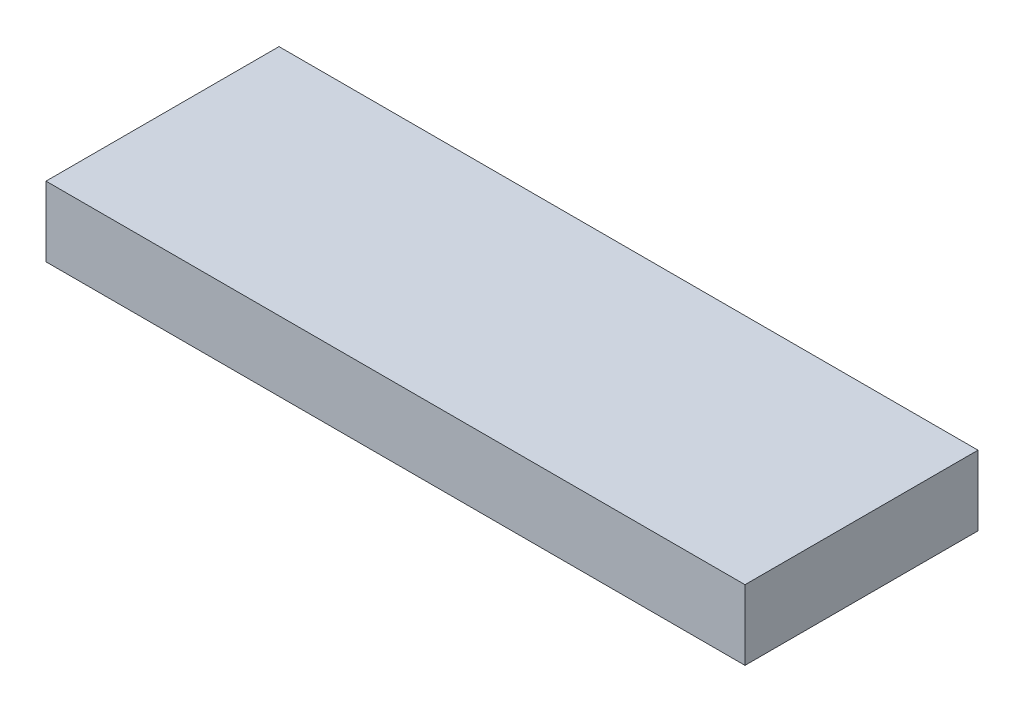
ISO-10303-21;
HEADER;
FILE_DESCRIPTION(('STEP AP214'),'2;1');
FILE_NAME('part.step','',(''),(''),'','','');
FILE_SCHEMA(('AUTOMOTIVE_DESIGN { 1 0 10303 214 1 1 1 1 }'));
ENDSEC;
DATA;
#1=APPLICATION_CONTEXT('core data for automotive mechanical design processes');
#2=APPLICATION_PROTOCOL_DEFINITION('international standard','automotive_design',2000,#1);
#3=PRODUCT_CONTEXT('',#1,'mechanical');
#4=PRODUCT('Part','Part','',(#3));
#5=PRODUCT_RELATED_PRODUCT_CATEGORY('part','',(#4));
#6=PRODUCT_DEFINITION_FORMATION('','',#4);
#7=PRODUCT_DEFINITION_CONTEXT('part definition',#1,'design');
#8=PRODUCT_DEFINITION('design','',#6,#7);
#9=PRODUCT_DEFINITION_SHAPE('','',#8);
#10=(LENGTH_UNIT() NAMED_UNIT(*) SI_UNIT(.MILLI.,.METRE.));
#11=(NAMED_UNIT(*) PLANE_ANGLE_UNIT() SI_UNIT($,.RADIAN.));
#12=(NAMED_UNIT(*) SI_UNIT($,.STERADIAN.) SOLID_ANGLE_UNIT());
#13=UNCERTAINTY_MEASURE_WITH_UNIT(LENGTH_MEASURE(1.E-05),#10,'distance_accuracy_value','');
#14=(GEOMETRIC_REPRESENTATION_CONTEXT(3) GLOBAL_UNCERTAINTY_ASSIGNED_CONTEXT((#13)) GLOBAL_UNIT_ASSIGNED_CONTEXT((#10,
#11,#12)) REPRESENTATION_CONTEXT('',''));
#15=CARTESIAN_POINT('',(0.,0.,0.));
#16=DIRECTION('',(0.,0.,1.));
#17=DIRECTION('',(1.,0.,0.));
#18=AXIS2_PLACEMENT_3D('',#15,#16,#17);
#19=CARTESIAN_POINT('',(-300.,-50.01,50.));
#20=DIRECTION('',(0.,0.,1.));
#21=DIRECTION('',(1.,0.,0.));
#22=AXIS2_PLACEMENT_3D('',#19,#20,#21);
#23=PLANE('',#22);
#24=DIRECTION('',(0.,1.,0.));
#25=VECTOR('',#24,1.);
#26=CARTESIAN_POINT('',(-300.,0.,50.));
#27=LINE('',#26,#25);
#28=CARTESIAN_POINT('',(-300.,-50.,50.));
#29=VERTEX_POINT('',#28);
#30=CARTESIAN_POINT('',(-300.,-47.,50.));
#31=VERTEX_POINT('',#30);
#32=EDGE_CURVE('E60',#29,#31,#27,.T.);
#33=ORIENTED_EDGE('',*,*,#32,.F.);
#34=DIRECTION('',(1.,0.,0.));
#35=VECTOR('',#34,1.);
#36=CARTESIAN_POINT('',(-300.,-50.,50.));
#37=LINE('',#36,#35);
#38=CARTESIAN_POINT('',(-270.,-50.,50.));
#39=VERTEX_POINT('',#38);
#40=EDGE_CURVE('E94',#29,#39,#37,.T.);
#41=ORIENTED_EDGE('',*,*,#40,.T.);
#42=DIRECTION('',(0.,1.,0.));
#43=VECTOR('',#42,1.);
#44=CARTESIAN_POINT('',(-270.,-50.01,50.));
#45=LINE('',#44,#43);
#46=CARTESIAN_POINT('',(-270.,-47.,50.));
#47=VERTEX_POINT('',#46);
#48=EDGE_CURVE('E44',#39,#47,#45,.T.);
#49=ORIENTED_EDGE('',*,*,#48,.T.);
#50=DIRECTION('',(-1.,0.,0.));
#51=VECTOR('',#50,1.);
#52=CARTESIAN_POINT('',(-300.,-47.,50.));
#53=LINE('',#52,#51);
#54=EDGE_CURVE('E104',#47,#31,#53,.T.);
#55=ORIENTED_EDGE('',*,*,#54,.T.);
#56=EDGE_LOOP('',(#33,#41,#49,#55));
#57=FACE_BOUND('',#56,.T.);
#58=ADVANCED_FACE('F35',(#57),#23,.T.);
#59=CARTESIAN_POINT('',(-300.,-50.01,40.));
#60=DIRECTION('',(0.,0.,-1.));
#61=DIRECTION('',(-1.,0.,0.));
#62=AXIS2_PLACEMENT_3D('',#59,#60,#61);
#63=PLANE('',#62);
#64=DIRECTION('',(0.,1.,0.));
#65=VECTOR('',#64,1.);
#66=CARTESIAN_POINT('',(-270.,-50.01,40.));
#67=LINE('',#66,#65);
#68=CARTESIAN_POINT('',(-270.,-50.,40.));
#69=VERTEX_POINT('',#68);
#70=CARTESIAN_POINT('',(-270.,-47.,40.));
#71=VERTEX_POINT('',#70);
#72=EDGE_CURVE('E11',#69,#71,#67,.T.);
#73=ORIENTED_EDGE('',*,*,#72,.F.);
#74=DIRECTION('',(-1.,0.,0.));
#75=VECTOR('',#74,1.);
#76=CARTESIAN_POINT('',(-300.,-50.,40.));
#77=LINE('',#76,#75);
#78=CARTESIAN_POINT('',(-300.,-50.,40.));
#79=VERTEX_POINT('',#78);
#80=EDGE_CURVE('E95',#69,#79,#77,.T.);
#81=ORIENTED_EDGE('',*,*,#80,.T.);
#82=DIRECTION('',(0.,-1.,0.));
#83=VECTOR('',#82,1.);
#84=CARTESIAN_POINT('',(-300.,0.,40.));
#85=LINE('',#84,#83);
#86=CARTESIAN_POINT('',(-300.,-47.,40.));
#87=VERTEX_POINT('',#86);
#88=EDGE_CURVE('E52',#87,#79,#85,.T.);
#89=ORIENTED_EDGE('',*,*,#88,.F.);
#90=DIRECTION('',(1.,0.,0.));
#91=VECTOR('',#90,1.);
#92=CARTESIAN_POINT('',(-300.,-47.,40.));
#93=LINE('',#92,#91);
#94=EDGE_CURVE('E39',#87,#71,#93,.T.);
#95=ORIENTED_EDGE('',*,*,#94,.T.);
#96=EDGE_LOOP('',(#73,#81,#89,#95));
#97=FACE_BOUND('',#96,.T.);
#98=ADVANCED_FACE('F105',(#97),#63,.T.);
#99=CARTESIAN_POINT('',(-270.,-50.01,40.));
#100=DIRECTION('',(1.,0.,0.));
#101=DIRECTION('',(0.,0.,-1.));
#102=AXIS2_PLACEMENT_3D('',#99,#100,#101);
#103=PLANE('',#102);
#104=ORIENTED_EDGE('',*,*,#48,.F.);
#105=DIRECTION('',(0.,0.,-1.));
#106=VECTOR('',#105,1.);
#107=CARTESIAN_POINT('',(-270.,-50.,60.));
#108=LINE('',#107,#106);
#109=EDGE_CURVE('E81',#39,#69,#108,.T.);
#110=ORIENTED_EDGE('',*,*,#109,.T.);
#111=ORIENTED_EDGE('',*,*,#72,.T.);
#112=DIRECTION('',(0.,0.,1.));
#113=VECTOR('',#112,1.);
#114=CARTESIAN_POINT('',(-270.,-47.,3.));
#115=LINE('',#114,#113);
#116=EDGE_CURVE('E83',#71,#47,#115,.T.);
#117=ORIENTED_EDGE('',*,*,#116,.T.);
#118=EDGE_LOOP('',(#104,#110,#111,#117));
#119=FACE_BOUND('',#118,.T.);
#120=ADVANCED_FACE('F80',(#119),#103,.T.);
#121=CARTESIAN_POINT('',(-300.,0.,0.));
#122=DIRECTION('',(-1.,0.,0.));
#123=DIRECTION('',(0.,0.,1.));
#124=AXIS2_PLACEMENT_3D('',#121,#122,#123);
#125=PLANE('',#124);
#126=DIRECTION('',(0.,0.,-1.));
#127=VECTOR('',#126,1.);
#128=CARTESIAN_POINT('',(-300.,-50.,60.));
#129=LINE('',#128,#127);
#130=EDGE_CURVE('E100',#29,#79,#129,.T.);
#131=ORIENTED_EDGE('',*,*,#130,.F.);
#132=ORIENTED_EDGE('',*,*,#32,.T.);
#133=DIRECTION('',(0.,0.,1.));
#134=VECTOR('',#133,1.);
#135=CARTESIAN_POINT('',(-300.,-47.,3.));
#136=LINE('',#135,#134);
#137=EDGE_CURVE('E87',#87,#31,#136,.T.);
#138=ORIENTED_EDGE('',*,*,#137,.F.);
#139=ORIENTED_EDGE('',*,*,#88,.T.);
#140=EDGE_LOOP('',(#131,#132,#138,#139));
#141=FACE_BOUND('',#140,.T.);
#142=ADVANCED_FACE('F109',(#141),#125,.T.);
#143=CARTESIAN_POINT('',(-300.,-50.,60.));
#144=DIRECTION('',(0.,1.,0.));
#145=DIRECTION('',(0.,0.,1.));
#146=AXIS2_PLACEMENT_3D('',#143,#144,#145);
#147=PLANE('',#146);
#148=ORIENTED_EDGE('',*,*,#40,.F.);
#149=ORIENTED_EDGE('',*,*,#130,.T.);
#150=ORIENTED_EDGE('',*,*,#80,.F.);
#151=ORIENTED_EDGE('',*,*,#109,.F.);
#152=EDGE_LOOP('',(#148,#149,#150,#151));
#153=FACE_BOUND('',#152,.T.);
#154=ADVANCED_FACE('F92',(#153),#147,.F.);
#155=CARTESIAN_POINT('',(-300.,-47.,3.));
#156=DIRECTION('',(0.,-1.,0.));
#157=DIRECTION('',(0.,0.,-1.));
#158=AXIS2_PLACEMENT_3D('',#155,#156,#157);
#159=PLANE('',#158);
#160=ORIENTED_EDGE('',*,*,#54,.F.);
#161=ORIENTED_EDGE('',*,*,#116,.F.);
#162=ORIENTED_EDGE('',*,*,#94,.F.);
#163=ORIENTED_EDGE('',*,*,#137,.T.);
#164=EDGE_LOOP('',(#160,#161,#162,#163));
#165=FACE_BOUND('',#164,.T.);
#166=ADVANCED_FACE('F37',(#165),#159,.F.);
#167=CLOSED_SHELL('',(#58,#98,#120,#142,#154,#166));
#168=MANIFOLD_SOLID_BREP('B2',#167);
#169=ADVANCED_BREP_SHAPE_REPRESENTATION('',(#18,#168),#14);
#170=SHAPE_DEFINITION_REPRESENTATION(#9,#169);
ENDSEC;
END-ISO-10303-21;
